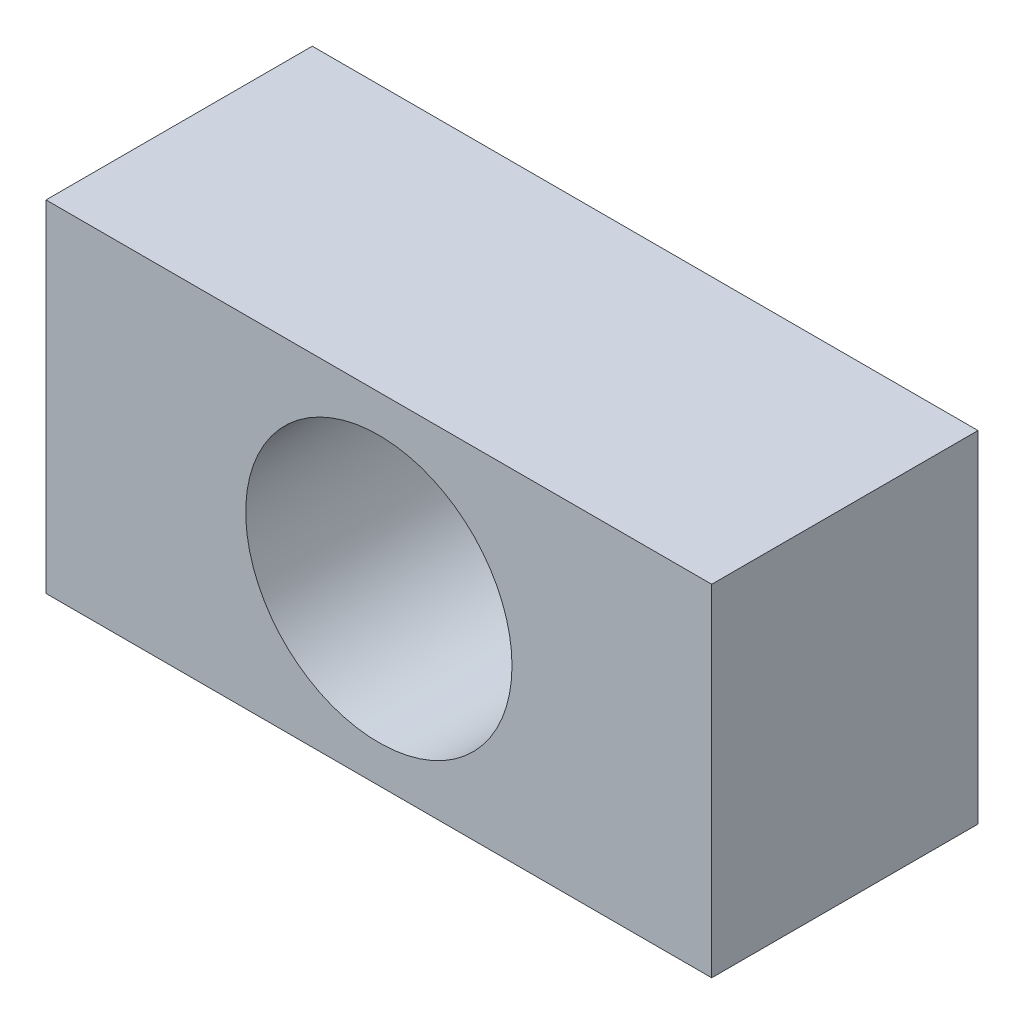
ISO-10303-21;
HEADER;
FILE_DESCRIPTION(('STEP AP214'),'2;1');
FILE_NAME('part.step','',(''),(''),'','','');
FILE_SCHEMA(('AUTOMOTIVE_DESIGN { 1 0 10303 214 1 1 1 1 }'));
ENDSEC;
DATA;
#1=APPLICATION_CONTEXT('core data for automotive mechanical design processes');
#2=APPLICATION_PROTOCOL_DEFINITION('international standard','automotive_design',2000,#1);
#3=PRODUCT_CONTEXT('',#1,'mechanical');
#4=PRODUCT('Part','Part','',(#3));
#5=PRODUCT_RELATED_PRODUCT_CATEGORY('part','',(#4));
#6=PRODUCT_DEFINITION_FORMATION('','',#4);
#7=PRODUCT_DEFINITION_CONTEXT('part definition',#1,'design');
#8=PRODUCT_DEFINITION('design','',#6,#7);
#9=PRODUCT_DEFINITION_SHAPE('','',#8);
#10=(LENGTH_UNIT() NAMED_UNIT(*) SI_UNIT(.MILLI.,.METRE.));
#11=(NAMED_UNIT(*) PLANE_ANGLE_UNIT() SI_UNIT($,.RADIAN.));
#12=(NAMED_UNIT(*) SI_UNIT($,.STERADIAN.) SOLID_ANGLE_UNIT());
#13=UNCERTAINTY_MEASURE_WITH_UNIT(LENGTH_MEASURE(1.E-05),#10,'distance_accuracy_value','');
#14=(GEOMETRIC_REPRESENTATION_CONTEXT(3) GLOBAL_UNCERTAINTY_ASSIGNED_CONTEXT((#13)) GLOBAL_UNIT_ASSIGNED_CONTEXT((#10,
#11,#12)) REPRESENTATION_CONTEXT('',''));
#15=CARTESIAN_POINT('',(0.,0.,0.));
#16=DIRECTION('',(0.,0.,1.));
#17=DIRECTION('',(1.,0.,0.));
#18=AXIS2_PLACEMENT_3D('',#15,#16,#17);
#19=CARTESIAN_POINT('',(0.,0.,3.));
#20=DIRECTION('',(0.,0.,1.));
#21=DIRECTION('',(1.,0.,0.));
#22=AXIS2_PLACEMENT_3D('',#19,#20,#21);
#23=PLANE('',#22);
#24=DIRECTION('',(0.,-1.,0.));
#25=VECTOR('',#24,1.);
#26=CARTESIAN_POINT('',(-2.65909090909092,0.0559090909090926,3.));
#27=LINE('',#26,#25);
#28=CARTESIAN_POINT('',(-2.65909090909092,0.0559090909090926,3.));
#29=VERTEX_POINT('',#28);
#30=CARTESIAN_POINT('',(-2.65909090909092,-3.78409090909091,3.));
#31=VERTEX_POINT('',#30);
#32=EDGE_CURVE('E92',#29,#31,#27,.T.);
#33=ORIENTED_EDGE('',*,*,#32,.T.);
#34=DIRECTION('',(1.,0.,0.));
#35=VECTOR('',#34,1.);
#36=CARTESIAN_POINT('',(-2.65909090909092,-3.78409090909091,3.));
#37=LINE('',#36,#35);
#38=CARTESIAN_POINT('',(4.84090909090908,-3.78409090909091,3.));
#39=VERTEX_POINT('',#38);
#40=EDGE_CURVE('E87',#31,#39,#37,.T.);
#41=ORIENTED_EDGE('',*,*,#40,.T.);
#42=DIRECTION('',(0.,1.,0.));
#43=VECTOR('',#42,1.);
#44=CARTESIAN_POINT('',(4.84090909090908,0.0559090909090926,3.));
#45=LINE('',#44,#43);
#46=CARTESIAN_POINT('',(4.84090909090908,0.0559090909090926,3.));
#47=VERTEX_POINT('',#46);
#48=EDGE_CURVE('E90',#39,#47,#45,.T.);
#49=ORIENTED_EDGE('',*,*,#48,.T.);
#50=DIRECTION('',(-1.,0.,0.));
#51=VECTOR('',#50,1.);
#52=CARTESIAN_POINT('',(-2.65909090909092,0.0559090909090926,3.));
#53=LINE('',#52,#51);
#54=EDGE_CURVE('E57',#47,#29,#53,.T.);
#55=ORIENTED_EDGE('',*,*,#54,.T.);
#56=EDGE_LOOP('',(#33,#41,#49,#55));
#57=FACE_BOUND('',#56,.T.);
#58=CARTESIAN_POINT('',(1.09090909090908,-1.86409090909091,3.));
#59=DIRECTION('',(0.,0.,1.));
#60=DIRECTION('',(1.,0.,0.));
#61=AXIS2_PLACEMENT_3D('',#58,#59,#60);
#62=CIRCLE('',#61,1.5);
#63=CARTESIAN_POINT('',(2.59090909090908,-1.86409090909091,3.));
#64=VERTEX_POINT('',#63);
#65=EDGE_CURVE('E112',#64,#64,#62,.T.);
#66=ORIENTED_EDGE('',*,*,#65,.F.);
#67=EDGE_LOOP('',(#66));
#68=FACE_BOUND('',#67,.T.);
#69=ADVANCED_FACE('F39',(#57,#68),#23,.T.);
#70=CARTESIAN_POINT('',(0.,0.,0.));
#71=DIRECTION('',(0.,0.,1.));
#72=DIRECTION('',(1.,0.,0.));
#73=AXIS2_PLACEMENT_3D('',#70,#71,#72);
#74=PLANE('',#73);
#75=DIRECTION('',(0.,-1.,0.));
#76=VECTOR('',#75,1.);
#77=CARTESIAN_POINT('',(-2.65909090909092,0.0559090909090926,0.));
#78=LINE('',#77,#76);
#79=CARTESIAN_POINT('',(-2.65909090909092,0.0559090909090926,0.));
#80=VERTEX_POINT('',#79);
#81=CARTESIAN_POINT('',(-2.65909090909092,-3.78409090909091,0.));
#82=VERTEX_POINT('',#81);
#83=EDGE_CURVE('E108',#80,#82,#78,.T.);
#84=ORIENTED_EDGE('',*,*,#83,.F.);
#85=DIRECTION('',(-1.,0.,0.));
#86=VECTOR('',#85,1.);
#87=CARTESIAN_POINT('',(-2.65909090909092,0.0559090909090926,0.));
#88=LINE('',#87,#86);
#89=CARTESIAN_POINT('',(4.84090909090908,0.0559090909090926,0.));
#90=VERTEX_POINT('',#89);
#91=EDGE_CURVE('E80',#90,#80,#88,.T.);
#92=ORIENTED_EDGE('',*,*,#91,.F.);
#93=DIRECTION('',(0.,1.,0.));
#94=VECTOR('',#93,1.);
#95=CARTESIAN_POINT('',(4.84090909090908,0.0559090909090926,0.));
#96=LINE('',#95,#94);
#97=CARTESIAN_POINT('',(4.84090909090908,-3.78409090909091,0.));
#98=VERTEX_POINT('',#97);
#99=EDGE_CURVE('E74',#98,#90,#96,.T.);
#100=ORIENTED_EDGE('',*,*,#99,.F.);
#101=DIRECTION('',(1.,0.,0.));
#102=VECTOR('',#101,1.);
#103=CARTESIAN_POINT('',(-2.65909090909092,-3.78409090909091,0.));
#104=LINE('',#103,#102);
#105=EDGE_CURVE('E97',#82,#98,#104,.T.);
#106=ORIENTED_EDGE('',*,*,#105,.F.);
#107=EDGE_LOOP('',(#84,#92,#100,#106));
#108=FACE_BOUND('',#107,.T.);
#109=CARTESIAN_POINT('',(1.09090909090908,-1.86409090909091,0.));
#110=DIRECTION('',(0.,0.,1.));
#111=DIRECTION('',(1.,0.,0.));
#112=AXIS2_PLACEMENT_3D('',#109,#110,#111);
#113=CIRCLE('',#112,1.5);
#114=CARTESIAN_POINT('',(2.59090909090908,-1.86409090909091,0.));
#115=VERTEX_POINT('',#114);
#116=EDGE_CURVE('E130',#115,#115,#113,.T.);
#117=ORIENTED_EDGE('',*,*,#116,.T.);
#118=EDGE_LOOP('',(#117));
#119=FACE_BOUND('',#118,.T.);
#120=ADVANCED_FACE('F125',(#108,#119),#74,.F.);
#121=CARTESIAN_POINT('',(-2.65909090909092,0.0559090909090926,3.));
#122=DIRECTION('',(1.,0.,0.));
#123=DIRECTION('',(0.,1.,0.));
#124=AXIS2_PLACEMENT_3D('',#121,#122,#123);
#125=PLANE('',#124);
#126=ORIENTED_EDGE('',*,*,#83,.T.);
#127=DIRECTION('',(0.,0.,-1.));
#128=VECTOR('',#127,1.);
#129=CARTESIAN_POINT('',(-2.65909090909092,-3.78409090909091,3.));
#130=LINE('',#129,#128);
#131=EDGE_CURVE('E11',#31,#82,#130,.T.);
#132=ORIENTED_EDGE('',*,*,#131,.F.);
#133=ORIENTED_EDGE('',*,*,#32,.F.);
#134=DIRECTION('',(0.,0.,-1.));
#135=VECTOR('',#134,1.);
#136=CARTESIAN_POINT('',(-2.65909090909092,0.0559090909090926,3.));
#137=LINE('',#136,#135);
#138=EDGE_CURVE('E104',#29,#80,#137,.T.);
#139=ORIENTED_EDGE('',*,*,#138,.T.);
#140=EDGE_LOOP('',(#126,#132,#133,#139));
#141=FACE_BOUND('',#140,.T.);
#142=ADVANCED_FACE('F41',(#141),#125,.F.);
#143=CARTESIAN_POINT('',(-2.65909090909092,-3.78409090909091,3.));
#144=DIRECTION('',(0.,1.,0.));
#145=DIRECTION('',(0.,0.,1.));
#146=AXIS2_PLACEMENT_3D('',#143,#144,#145);
#147=PLANE('',#146);
#148=ORIENTED_EDGE('',*,*,#105,.T.);
#149=DIRECTION('',(0.,0.,-1.));
#150=VECTOR('',#149,1.);
#151=CARTESIAN_POINT('',(4.84090909090908,-3.78409090909091,3.));
#152=LINE('',#151,#150);
#153=EDGE_CURVE('E49',#39,#98,#152,.T.);
#154=ORIENTED_EDGE('',*,*,#153,.F.);
#155=ORIENTED_EDGE('',*,*,#40,.F.);
#156=ORIENTED_EDGE('',*,*,#131,.T.);
#157=EDGE_LOOP('',(#148,#154,#155,#156));
#158=FACE_BOUND('',#157,.T.);
#159=ADVANCED_FACE('F96',(#158),#147,.F.);
#160=CARTESIAN_POINT('',(4.84090909090908,0.0559090909090926,3.));
#161=DIRECTION('',(-1.,0.,0.));
#162=DIRECTION('',(0.,-1.,0.));
#163=AXIS2_PLACEMENT_3D('',#160,#161,#162);
#164=PLANE('',#163);
#165=ORIENTED_EDGE('',*,*,#99,.T.);
#166=DIRECTION('',(0.,0.,-1.));
#167=VECTOR('',#166,1.);
#168=CARTESIAN_POINT('',(4.84090909090908,0.0559090909090926,3.));
#169=LINE('',#168,#167);
#170=EDGE_CURVE('E99',#47,#90,#169,.T.);
#171=ORIENTED_EDGE('',*,*,#170,.F.);
#172=ORIENTED_EDGE('',*,*,#48,.F.);
#173=ORIENTED_EDGE('',*,*,#153,.T.);
#174=EDGE_LOOP('',(#165,#171,#172,#173));
#175=FACE_BOUND('',#174,.T.);
#176=ADVANCED_FACE('F100',(#175),#164,.F.);
#177=CARTESIAN_POINT('',(-2.65909090909092,0.0559090909090926,3.));
#178=DIRECTION('',(0.,-1.,0.));
#179=DIRECTION('',(0.,0.,-1.));
#180=AXIS2_PLACEMENT_3D('',#177,#178,#179);
#181=PLANE('',#180);
#182=ORIENTED_EDGE('',*,*,#91,.T.);
#183=ORIENTED_EDGE('',*,*,#138,.F.);
#184=ORIENTED_EDGE('',*,*,#54,.F.);
#185=ORIENTED_EDGE('',*,*,#170,.T.);
#186=EDGE_LOOP('',(#182,#183,#184,#185));
#187=FACE_BOUND('',#186,.T.);
#188=ADVANCED_FACE('F122',(#187),#181,.F.);
#189=CARTESIAN_POINT('',(1.09090909090908,-1.86409090909091,3.));
#190=DIRECTION('',(0.,0.,-1.));
#191=DIRECTION('',(-1.,0.,0.));
#192=AXIS2_PLACEMENT_3D('',#189,#190,#191);
#193=CYLINDRICAL_SURFACE('',#192,1.5);
#194=ORIENTED_EDGE('',*,*,#65,.T.);
#195=EDGE_LOOP('',(#194));
#196=FACE_BOUND('',#195,.T.);
#197=ORIENTED_EDGE('',*,*,#116,.F.);
#198=EDGE_LOOP('',(#197));
#199=FACE_BOUND('',#198,.T.);
#200=ADVANCED_FACE('F138',(#196,#199),#193,.F.);
#201=CLOSED_SHELL('',(#69,#120,#142,#159,#176,#188,#200));
#202=MANIFOLD_SOLID_BREP('B2',#201);
#203=ADVANCED_BREP_SHAPE_REPRESENTATION('',(#18,#202),#14);
#204=SHAPE_DEFINITION_REPRESENTATION(#9,#203);
ENDSEC;
END-ISO-10303-21;
